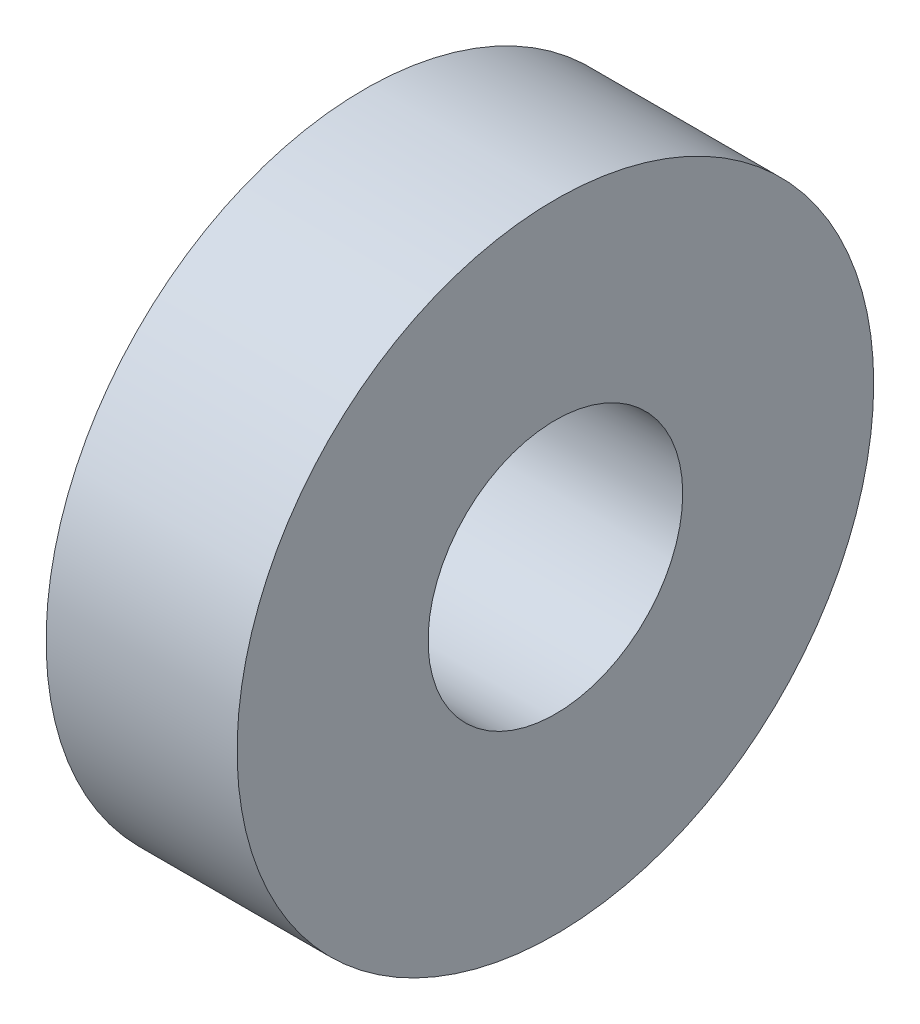
ISO-10303-21;
HEADER;
FILE_DESCRIPTION(('STEP AP214'),'2;1');
FILE_NAME('part.step','',(''),(''),'','','');
FILE_SCHEMA(('AUTOMOTIVE_DESIGN { 1 0 10303 214 1 1 1 1 }'));
ENDSEC;
DATA;
#1=APPLICATION_CONTEXT('core data for automotive mechanical design processes');
#2=APPLICATION_PROTOCOL_DEFINITION('international standard','automotive_design',2000,#1);
#3=PRODUCT_CONTEXT('',#1,'mechanical');
#4=PRODUCT('Part','Part','',(#3));
#5=PRODUCT_RELATED_PRODUCT_CATEGORY('part','',(#4));
#6=PRODUCT_DEFINITION_FORMATION('','',#4);
#7=PRODUCT_DEFINITION_CONTEXT('part definition',#1,'design');
#8=PRODUCT_DEFINITION('design','',#6,#7);
#9=PRODUCT_DEFINITION_SHAPE('','',#8);
#10=(LENGTH_UNIT() NAMED_UNIT(*) SI_UNIT(.MILLI.,.METRE.));
#11=(NAMED_UNIT(*) PLANE_ANGLE_UNIT() SI_UNIT($,.RADIAN.));
#12=(NAMED_UNIT(*) SI_UNIT($,.STERADIAN.) SOLID_ANGLE_UNIT());
#13=UNCERTAINTY_MEASURE_WITH_UNIT(LENGTH_MEASURE(1.E-05),#10,'distance_accuracy_value','');
#14=(GEOMETRIC_REPRESENTATION_CONTEXT(3) GLOBAL_UNCERTAINTY_ASSIGNED_CONTEXT((#13)) GLOBAL_UNIT_ASSIGNED_CONTEXT((#10,
#11,#12)) REPRESENTATION_CONTEXT('',''));
#15=CARTESIAN_POINT('',(0.,0.,0.));
#16=DIRECTION('',(0.,0.,1.));
#17=DIRECTION('',(1.,0.,0.));
#18=AXIS2_PLACEMENT_3D('',#15,#16,#17);
#19=CARTESIAN_POINT('',(3.,0.,0.));
#20=DIRECTION('',(-1.,0.,0.));
#21=DIRECTION('',(0.,0.,1.));
#22=AXIS2_PLACEMENT_3D('',#19,#20,#21);
#23=CYLINDRICAL_SURFACE('',#22,5.);
#24=CARTESIAN_POINT('',(3.,0.,0.));
#25=DIRECTION('',(1.,0.,0.));
#26=DIRECTION('',(0.,0.,-1.));
#27=AXIS2_PLACEMENT_3D('',#24,#25,#26);
#28=CIRCLE('',#27,5.);
#29=CARTESIAN_POINT('',(3.,0.,-5.));
#30=VERTEX_POINT('',#29);
#31=EDGE_CURVE('E10',#30,#30,#28,.T.);
#32=ORIENTED_EDGE('',*,*,#31,.F.);
#33=EDGE_LOOP('',(#32));
#34=FACE_BOUND('',#33,.T.);
#35=CARTESIAN_POINT('',(0.,0.,0.));
#36=DIRECTION('',(1.,0.,0.));
#37=DIRECTION('',(0.,0.,-1.));
#38=AXIS2_PLACEMENT_3D('',#35,#36,#37);
#39=CIRCLE('',#38,5.);
#40=CARTESIAN_POINT('',(0.,0.,-5.));
#41=VERTEX_POINT('',#40);
#42=EDGE_CURVE('E34',#41,#41,#39,.T.);
#43=ORIENTED_EDGE('',*,*,#42,.T.);
#44=EDGE_LOOP('',(#43));
#45=FACE_BOUND('',#44,.T.);
#46=ADVANCED_FACE('F31',(#34,#45),#23,.T.);
#47=CARTESIAN_POINT('',(3.,0.,0.));
#48=DIRECTION('',(1.,0.,0.));
#49=DIRECTION('',(0.,0.,-1.));
#50=AXIS2_PLACEMENT_3D('',#47,#48,#49);
#51=PLANE('',#50);
#52=CARTESIAN_POINT('',(3.,0.,0.));
#53=DIRECTION('',(1.,0.,0.));
#54=DIRECTION('',(0.,0.,-1.));
#55=AXIS2_PLACEMENT_3D('',#52,#53,#54);
#56=CIRCLE('',#55,2.);
#57=CARTESIAN_POINT('',(3.,0.,-2.));
#58=VERTEX_POINT('',#57);
#59=EDGE_CURVE('E43',#58,#58,#56,.T.);
#60=ORIENTED_EDGE('',*,*,#59,.F.);
#61=EDGE_LOOP('',(#60));
#62=FACE_BOUND('',#61,.T.);
#63=ORIENTED_EDGE('',*,*,#31,.T.);
#64=EDGE_LOOP('',(#63));
#65=FACE_BOUND('',#64,.T.);
#66=ADVANCED_FACE('F58',(#62,#65),#51,.T.);
#67=CARTESIAN_POINT('',(0.,0.,0.));
#68=DIRECTION('',(1.,0.,0.));
#69=DIRECTION('',(0.,0.,-1.));
#70=AXIS2_PLACEMENT_3D('',#67,#68,#69);
#71=PLANE('',#70);
#72=CARTESIAN_POINT('',(0.,0.,0.));
#73=DIRECTION('',(1.,0.,0.));
#74=DIRECTION('',(0.,0.,-1.));
#75=AXIS2_PLACEMENT_3D('',#72,#73,#74);
#76=CIRCLE('',#75,2.);
#77=CARTESIAN_POINT('',(0.,0.,-2.));
#78=VERTEX_POINT('',#77);
#79=EDGE_CURVE('E41',#78,#78,#76,.T.);
#80=ORIENTED_EDGE('',*,*,#79,.T.);
#81=EDGE_LOOP('',(#80));
#82=FACE_BOUND('',#81,.T.);
#83=ORIENTED_EDGE('',*,*,#42,.F.);
#84=EDGE_LOOP('',(#83));
#85=FACE_BOUND('',#84,.T.);
#86=ADVANCED_FACE('F49',(#82,#85),#71,.F.);
#87=CARTESIAN_POINT('',(0.,0.,0.));
#88=DIRECTION('',(1.,0.,0.));
#89=DIRECTION('',(0.,0.,-1.));
#90=AXIS2_PLACEMENT_3D('',#87,#88,#89);
#91=CYLINDRICAL_SURFACE('',#90,2.);
#92=ORIENTED_EDGE('',*,*,#79,.F.);
#93=EDGE_LOOP('',(#92));
#94=FACE_BOUND('',#93,.T.);
#95=ORIENTED_EDGE('',*,*,#59,.T.);
#96=EDGE_LOOP('',(#95));
#97=FACE_BOUND('',#96,.T.);
#98=ADVANCED_FACE('F52',(#94,#97),#91,.F.);
#99=CLOSED_SHELL('',(#46,#66,#86,#98));
#100=MANIFOLD_SOLID_BREP('B2',#99);
#101=ADVANCED_BREP_SHAPE_REPRESENTATION('',(#18,#100),#14);
#102=SHAPE_DEFINITION_REPRESENTATION(#9,#101);
ENDSEC;
END-ISO-10303-21;
